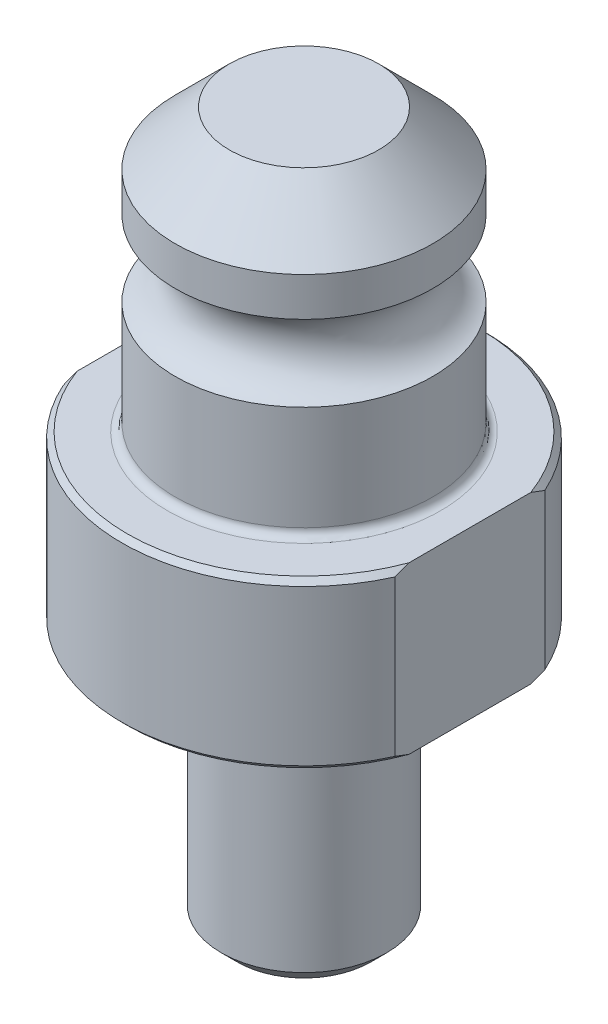
ISO-10303-21;
HEADER;
FILE_DESCRIPTION(('STEP AP214'),'2;1');
FILE_NAME('part.step','',(''),(''),'','','');
FILE_SCHEMA(('AUTOMOTIVE_DESIGN { 1 0 10303 214 1 1 1 1 }'));
ENDSEC;
DATA;
#1=APPLICATION_CONTEXT('core data for automotive mechanical design processes');
#2=APPLICATION_PROTOCOL_DEFINITION('international standard','automotive_design',2000,#1);
#3=PRODUCT_CONTEXT('',#1,'mechanical');
#4=PRODUCT('Part','Part','',(#3));
#5=PRODUCT_RELATED_PRODUCT_CATEGORY('part','',(#4));
#6=PRODUCT_DEFINITION_FORMATION('','',#4);
#7=PRODUCT_DEFINITION_CONTEXT('part definition',#1,'design');
#8=PRODUCT_DEFINITION('design','',#6,#7);
#9=PRODUCT_DEFINITION_SHAPE('','',#8);
#10=(LENGTH_UNIT() NAMED_UNIT(*) SI_UNIT(.MILLI.,.METRE.));
#11=(NAMED_UNIT(*) PLANE_ANGLE_UNIT() SI_UNIT($,.RADIAN.));
#12=(NAMED_UNIT(*) SI_UNIT($,.STERADIAN.) SOLID_ANGLE_UNIT());
#13=UNCERTAINTY_MEASURE_WITH_UNIT(LENGTH_MEASURE(1.E-05),#10,'distance_accuracy_value','');
#14=(GEOMETRIC_REPRESENTATION_CONTEXT(3) GLOBAL_UNCERTAINTY_ASSIGNED_CONTEXT((#13)) GLOBAL_UNIT_ASSIGNED_CONTEXT((#10,
#11,#12)) REPRESENTATION_CONTEXT('',''));
#15=CARTESIAN_POINT('',(0.,0.,0.));
#16=DIRECTION('',(0.,0.,1.));
#17=DIRECTION('',(1.,0.,0.));
#18=AXIS2_PLACEMENT_3D('',#15,#16,#17);
#19=CARTESIAN_POINT('',(0.,-24.9936,0.));
#20=DIRECTION('',(0.,1.,0.));
#21=DIRECTION('',(-1.,0.,0.));
#22=AXIS2_PLACEMENT_3D('',#19,#20,#21);
#23=CYLINDRICAL_SURFACE('',#22,17.5006);
#24=DIRECTION('',(0.,1.,0.));
#25=VECTOR('',#24,1.);
#26=CARTESIAN_POINT('',(-15.9512,-24.9936,-7.19932072629079));
#27=LINE('',#26,#25);
#28=CARTESIAN_POINT('',(-15.9512,0.507999999999996,-7.19932072629079));
#29=VERTEX_POINT('',#28);
#30=CARTESIAN_POINT('',(-15.9512,15.4432,-7.19932072629079));
#31=VERTEX_POINT('',#30);
#32=EDGE_CURVE('E178',#29,#31,#27,.T.);
#33=ORIENTED_EDGE('',*,*,#32,.T.);
#34=CARTESIAN_POINT('',(0.,15.4432,0.));
#35=DIRECTION('',(0.,1.,0.));
#36=DIRECTION('',(-1.,0.,0.));
#37=AXIS2_PLACEMENT_3D('',#34,#35,#36);
#38=CIRCLE('',#37,17.5006);
#39=CARTESIAN_POINT('',(15.9512,15.4432,-7.19932072629078));
#40=VERTEX_POINT('',#39);
#41=EDGE_CURVE('E196',#31,#40,#38,.F.);
#42=ORIENTED_EDGE('',*,*,#41,.T.);
#43=DIRECTION('',(0.,1.,0.));
#44=VECTOR('',#43,1.);
#45=CARTESIAN_POINT('',(15.9512,-24.9936,-7.19932072629078));
#46=LINE('',#45,#44);
#47=CARTESIAN_POINT('',(15.9512,0.507999999999994,-7.19932072629078));
#48=VERTEX_POINT('',#47);
#49=EDGE_CURVE('E158',#48,#40,#46,.T.);
#50=ORIENTED_EDGE('',*,*,#49,.F.);
#51=CARTESIAN_POINT('',(0.,0.507999999999995,0.));
#52=DIRECTION('',(0.,-1.,0.));
#53=DIRECTION('',(1.,0.,0.));
#54=AXIS2_PLACEMENT_3D('',#51,#52,#53);
#55=CIRCLE('',#54,17.5006);
#56=EDGE_CURVE('E199',#48,#29,#55,.F.);
#57=ORIENTED_EDGE('',*,*,#56,.T.);
#58=EDGE_LOOP('',(#33,#42,#50,#57));
#59=FACE_BOUND('',#58,.T.);
#60=ADVANCED_FACE('F31',(#59),#23,.T.);
#61=CARTESIAN_POINT('',(0.,0.507999999999995,0.));
#62=DIRECTION('',(0.,1.,0.));
#63=DIRECTION('',(-1.,0.,0.));
#64=AXIS2_PLACEMENT_3D('',#61,#62,#63);
#65=CONICAL_SURFACE('',#64,17.5006,0.785398163397452);
#66=CARTESIAN_POINT('',(-15.9512,5.49018623231728,-15.8440807662697));
#67=CARTESIAN_POINT('',(-15.9512,5.33331855744457,-15.6214794728509));
#68=CARTESIAN_POINT('',(-15.9512,5.17755738640043,-15.3980992119657));
#69=CARTESIAN_POINT('',(-15.9512,4.86847005721532,-14.9496497067666));
#70=CARTESIAN_POINT('',(-15.9512,4.71514398210003,-14.7245804052477));
#71=CARTESIAN_POINT('',(-15.9512,4.25903741321897,-14.0464719794216));
#72=CARTESIAN_POINT('',(-15.9512,3.96026306609822,-13.5907224159838));
#73=CARTESIAN_POINT('',(-15.9512,3.37200436886921,-12.6651342669889));
#74=CARTESIAN_POINT('',(-15.9512,3.0826850896435,-12.1951904248123));
#75=CARTESIAN_POINT('',(-15.9512,2.52043403952877,-11.2456262368423));
#76=CARTESIAN_POINT('',(-15.9512,2.24750036290198,-10.7660070250515));
#77=CARTESIAN_POINT('',(-15.9512,1.71400849174468,-9.78124920731766));
#78=CARTESIAN_POINT('',(-15.9512,1.45406329921326,-9.27577624291654));
#79=CARTESIAN_POINT('',(-15.9512,0.960948243877733,-8.25169575464089));
#80=CARTESIAN_POINT('',(-15.9512,0.72778343846775,-7.73308577237696));
#81=CARTESIAN_POINT('',(-15.9512,0.296046827262793,-6.6845797919387));
#82=CARTESIAN_POINT('',(-15.9512,0.0973072308993037,-6.15475352363041));
#83=CARTESIAN_POINT('',(-15.9512,-0.259177017835615,-5.08155110446057));
#84=CARTESIAN_POINT('',(-15.9512,-0.41694750603537,-4.53818373098553));
#85=CARTESIAN_POINT('',(-15.9512,-0.613327603162929,-3.72875630379116));
#86=CARTESIAN_POINT('',(-15.9512,-0.670953730322471,-3.46723716560476));
#87=CARTESIAN_POINT('',(-15.9512,-0.774423684269977,-2.9418913355493));
#88=CARTESIAN_POINT('',(-15.9512,-0.820269109873936,-2.678064961837));
#89=CARTESIAN_POINT('',(-15.9512,-0.899494742104051,-2.14844974124866));
#90=CARTESIAN_POINT('',(-15.9512,-0.932870672275868,-1.88266025292612));
#91=CARTESIAN_POINT('',(-15.9512,-0.986589835027558,-1.34975733354528));
#92=CARTESIAN_POINT('',(-15.9512,-1.00693294641153,-1.08264389019843));
#93=CARTESIAN_POINT('',(-15.9512,-1.03404617768828,-0.551410929993733));
#94=CARTESIAN_POINT('',(-15.9512,-1.0409991636762,-0.287300775742793));
#95=CARTESIAN_POINT('',(-15.9512,-1.04176714482769,0.240936131459228));
#96=CARTESIAN_POINT('',(-15.9512,-1.03558223166201,0.505062884281631));
#97=CARTESIAN_POINT('',(-15.9512,-1.01017894135487,1.03267143191991));
#98=CARTESIAN_POINT('',(-15.9512,-0.990961481674179,1.29615327082591));
#99=CARTESIAN_POINT('',(-15.9512,-0.9398263765106,1.8218929152748));
#100=CARTESIAN_POINT('',(-15.9512,-0.907907105985949,2.0841505598517));
#101=CARTESIAN_POINT('',(-15.9512,-0.794361149684901,2.86448675231813));
#102=CARTESIAN_POINT('',(-15.9512,-0.69474503623291,3.38003065377401));
#103=CARTESIAN_POINT('',(-15.9512,-0.452899788931995,4.40083717981346));
#104=CARTESIAN_POINT('',(-15.9512,-0.310665274140785,4.90609849752405));
#105=CARTESIAN_POINT('',(-15.9512,0.0119416656369383,5.91127661224854));
#106=CARTESIAN_POINT('',(-15.9512,0.192777145507108,6.41104317311145));
#107=CARTESIAN_POINT('',(-15.9512,0.584957702157397,7.39832008009631));
#108=CARTESIAN_POINT('',(-15.9512,0.79630210597568,7.88583069627985));
#109=CARTESIAN_POINT('',(-15.9512,1.17546115657222,8.70203049024443));
#110=CARTESIAN_POINT('',(-15.9512,1.3368504175566,9.0337419156856));
#111=CARTESIAN_POINT('',(-15.9512,1.67002431630826,9.69192141994139));
#112=CARTESIAN_POINT('',(-15.9512,1.84180954631686,10.0183891986909));
#113=CARTESIAN_POINT('',(-15.9512,2.19444965201561,10.666586842449));
#114=CARTESIAN_POINT('',(-15.9512,2.37530909892574,10.9883142116903));
#115=CARTESIAN_POINT('',(-15.9512,2.744827671878,11.6272609125146));
#116=CARTESIAN_POINT('',(-15.9512,2.93348702343625,11.9444801133976));
#117=CARTESIAN_POINT('',(-15.9512,3.31194152712336,12.5655260462383));
#118=CARTESIAN_POINT('',(-15.9512,3.50154064403976,12.8694725085367));
#119=CARTESIAN_POINT('',(-15.9512,3.88633596349832,13.4738063726896));
#120=CARTESIAN_POINT('',(-15.9512,4.08153229542715,13.7741936920428));
#121=CARTESIAN_POINT('',(-15.9512,4.47650493516132,14.3712128296604));
#122=CARTESIAN_POINT('',(-15.9512,4.6762730227307,14.6678500962076));
#123=CARTESIAN_POINT('',(-15.9512,5.08012687348065,15.258132523735));
#124=CARTESIAN_POINT('',(-15.9512,5.28421223726466,15.5517779578017));
#125=CARTESIAN_POINT('',(-15.9512,5.49018623231728,15.8440807662697));
#126=B_SPLINE_CURVE_WITH_KNOTS('',3,(#66,#67,#68,#69,#70,#71,#72,#73,#74,#75,#76,#77,#78,#79,
#80,#81,#82,#83,#84,#85,#86,#87,#88,#89,#90,#91,#92,#93,#94,#95,#96,#97,#98,#99,#100,#101,#102,
#103,#104,#105,#106,#107,#108,#109,#110,#111,#112,#113,#114,#115,#116,#117,#118,#119,#120,#121,
#122,#123,#124,#125),.UNSPECIFIED.,.F.,.F.,(4,2,2,2,2,2,2,2,2,2,2,2,2,2,2,2,2,2,2,2,2,2,2,2,2,2,
2,2,2,4),(0.,0.8169572077873,1.63394221055412,3.26861060354255,4.92393249487228,
6.57906148848407,8.28361939192268,9.98849866846517,11.6848189458543,13.3800668821591,
14.1832237311102,14.9862715221236,15.789594468748,16.5929248855931,17.3852043496372,
18.1774782855061,18.9696964529333,19.7620160076145,21.3349808211931,22.9081443189481,
24.5013619374286,26.0945444182926,27.2010301148671,28.3075789055668,29.414690839609,
30.5218348056339,31.5964674110226,32.6711248779539,33.7439820618858,34.816740424801),.UNSPECIFIED.);
#127=CARTESIAN_POINT('',(-15.9512,0.,-5.85727524707523));
#128=VERTEX_POINT('',#127);
#129=EDGE_CURVE('E179',#29,#128,#126,.T.);
#130=ORIENTED_EDGE('',*,*,#129,.F.);
#131=ORIENTED_EDGE('',*,*,#56,.F.);
#132=CARTESIAN_POINT('',(15.9512,5.49018623231727,15.8440807662697));
#133=CARTESIAN_POINT('',(15.9512,5.33331855744456,15.6214794728509));
#134=CARTESIAN_POINT('',(15.9512,5.17755738640042,15.3980992119657));
#135=CARTESIAN_POINT('',(15.9512,4.86847005721531,14.9496497067666));
#136=CARTESIAN_POINT('',(15.9512,4.71514398210003,14.7245804052477));
#137=CARTESIAN_POINT('',(15.9512,4.25903741321897,14.0464719794216));
#138=CARTESIAN_POINT('',(15.9512,3.96026306609821,13.5907224159837));
#139=CARTESIAN_POINT('',(15.9512,3.3720043688692,12.6651342669889));
#140=CARTESIAN_POINT('',(15.9512,3.08268508964349,12.1951904248123));
#141=CARTESIAN_POINT('',(15.9512,2.52043403952876,11.2456262368423));
#142=CARTESIAN_POINT('',(15.9512,2.24750036290198,10.7660070250515));
#143=CARTESIAN_POINT('',(15.9512,1.71400849174467,9.78124920731765));
#144=CARTESIAN_POINT('',(15.9512,1.45406329921325,9.27577624291652));
#145=CARTESIAN_POINT('',(15.9512,0.960948243877726,8.25169575464088));
#146=CARTESIAN_POINT('',(15.9512,0.727783438467745,7.73308577237695));
#147=CARTESIAN_POINT('',(15.9512,0.296046827262789,6.68457979193869));
#148=CARTESIAN_POINT('',(15.9512,0.0973072308992994,6.1547535236304));
#149=CARTESIAN_POINT('',(15.9512,-0.259177017835619,5.08155110446056));
#150=CARTESIAN_POINT('',(15.9512,-0.416947506035374,4.53818373098552));
#151=CARTESIAN_POINT('',(15.9512,-0.613327603162933,3.72875630379115));
#152=CARTESIAN_POINT('',(15.9512,-0.670953730322476,3.46723716560474));
#153=CARTESIAN_POINT('',(15.9512,-0.774423684269981,2.94189133554928));
#154=CARTESIAN_POINT('',(15.9512,-0.820269109873937,2.67806496183699));
#155=CARTESIAN_POINT('',(15.9512,-0.89949474210405,2.14844974124865));
#156=CARTESIAN_POINT('',(15.9512,-0.932870672275869,1.88266025292611));
#157=CARTESIAN_POINT('',(15.9512,-0.986589835027559,1.34975733354527));
#158=CARTESIAN_POINT('',(15.9512,-1.00693294641153,1.08264389019842));
#159=CARTESIAN_POINT('',(15.9512,-1.03404617768828,0.551410929993724));
#160=CARTESIAN_POINT('',(15.9512,-1.0409991636762,0.287300775742784));
#161=CARTESIAN_POINT('',(15.9512,-1.0417671448277,-0.240936131459235));
#162=CARTESIAN_POINT('',(15.9512,-1.03558223166201,-0.505062884281638));
#163=CARTESIAN_POINT('',(15.9512,-1.01017894135487,-1.03267143191992));
#164=CARTESIAN_POINT('',(15.9512,-0.99096148167418,-1.29615327082592));
#165=CARTESIAN_POINT('',(15.9512,-0.939826376510601,-1.82189291527481));
#166=CARTESIAN_POINT('',(15.9512,-0.907907105985949,-2.08415055985171));
#167=CARTESIAN_POINT('',(15.9512,-0.794361149684901,-2.86448675231814));
#168=CARTESIAN_POINT('',(15.9512,-0.694745036232908,-3.38003065377402));
#169=CARTESIAN_POINT('',(15.9512,-0.452899788931992,-4.40083717981347));
#170=CARTESIAN_POINT('',(15.9512,-0.310665274140782,-4.90609849752406));
#171=CARTESIAN_POINT('',(15.9512,0.0119416656369408,-5.91127661224855));
#172=CARTESIAN_POINT('',(15.9512,0.192777145507111,-6.41104317311146));
#173=CARTESIAN_POINT('',(15.9512,0.584957702157402,-7.39832008009632));
#174=CARTESIAN_POINT('',(15.9512,0.796302105975687,-7.88583069627986));
#175=CARTESIAN_POINT('',(15.9512,1.17546115657222,-8.70203049024443));
#176=CARTESIAN_POINT('',(15.9512,1.33685041755661,-9.03374191568561));
#177=CARTESIAN_POINT('',(15.9512,1.67002431630826,-9.6919214199414));
#178=CARTESIAN_POINT('',(15.9512,1.84180954631686,-10.0183891986909));
#179=CARTESIAN_POINT('',(15.9512,2.19444965201561,-10.666586842449));
#180=CARTESIAN_POINT('',(15.9512,2.37530909892574,-10.9883142116903));
#181=CARTESIAN_POINT('',(15.9512,2.74482767187801,-11.6272609125146));
#182=CARTESIAN_POINT('',(15.9512,2.93348702343625,-11.9444801133976));
#183=CARTESIAN_POINT('',(15.9512,3.31194152712336,-12.5655260462383));
#184=CARTESIAN_POINT('',(15.9512,3.50154064403976,-12.8694725085367));
#185=CARTESIAN_POINT('',(15.9512,3.88633596349832,-13.4738063726896));
#186=CARTESIAN_POINT('',(15.9512,4.08153229542715,-13.7741936920428));
#187=CARTESIAN_POINT('',(15.9512,4.47650493516131,-14.3712128296604));
#188=CARTESIAN_POINT('',(15.9512,4.67627302273069,-14.6678500962076));
#189=CARTESIAN_POINT('',(15.9512,5.08012687348064,-15.258132523735));
#190=CARTESIAN_POINT('',(15.9512,5.28421223726465,-15.5517779578016));
#191=CARTESIAN_POINT('',(15.9512,5.49018623231728,-15.8440807662697));
#192=B_SPLINE_CURVE_WITH_KNOTS('',3,(#132,#133,#134,#135,#136,#137,#138,#139,#140,#141,#142,
#143,#144,#145,#146,#147,#148,#149,#150,#151,#152,#153,#154,#155,#156,#157,#158,#159,#160,#161,
#162,#163,#164,#165,#166,#167,#168,#169,#170,#171,#172,#173,#174,#175,#176,#177,#178,#179,#180,
#181,#182,#183,#184,#185,#186,#187,#188,#189,#190,#191),.UNSPECIFIED.,.F.,.F.,(4,2,2,2,2,2,2,2,
2,2,2,2,2,2,2,2,2,2,2,2,2,2,2,2,2,2,2,2,2,4),(0.,0.816957207787301,1.63394221055412,
3.26861060354255,4.92393249487227,6.57906148848408,8.28361939192269,9.98849866846517,
11.6848189458543,13.3800668821591,14.1832237311102,14.9862715221236,15.789594468748,
16.5929248855931,17.3852043496372,18.1774782855061,18.9696964529333,19.7620160076145,
21.3349808211931,22.9081443189481,24.5013619374286,26.0945444182926,27.2010301148671,
28.3075789055668,29.414690839609,30.5218348056339,31.5964674110226,32.6711248779539,
33.7439820618857,34.816740424801),.UNSPECIFIED.);
#193=CARTESIAN_POINT('',(15.9512,0.,-5.85727524707523));
#194=VERTEX_POINT('',#193);
#195=EDGE_CURVE('E149',#194,#48,#192,.T.);
#196=ORIENTED_EDGE('',*,*,#195,.F.);
#197=CARTESIAN_POINT('',(0.,0.,0.));
#198=DIRECTION('',(0.,-1.,0.));
#199=DIRECTION('',(1.,0.,0.));
#200=AXIS2_PLACEMENT_3D('',#197,#198,#199);
#201=CIRCLE('',#200,16.9926);
#202=EDGE_CURVE('E116',#128,#194,#201,.T.);
#203=ORIENTED_EDGE('',*,*,#202,.F.);
#204=EDGE_LOOP('',(#130,#131,#196,#203));
#205=FACE_BOUND('',#204,.T.);
#206=ADVANCED_FACE('F166',(#205),#65,.T.);
#207=CARTESIAN_POINT('',(0.,15.9512,0.));
#208=DIRECTION('',(0.,-1.,0.));
#209=DIRECTION('',(1.,0.,0.));
#210=AXIS2_PLACEMENT_3D('',#207,#208,#209);
#211=CONICAL_SURFACE('',#210,16.9926,0.785398163397424);
#212=CARTESIAN_POINT('',(-15.9512,10.4610137676824,15.8440807662697));
#213=CARTESIAN_POINT('',(-15.9512,10.6178814425551,15.6214794728509));
#214=CARTESIAN_POINT('',(-15.9512,10.7736426135993,15.3980992119657));
#215=CARTESIAN_POINT('',(-15.9512,11.0827299427844,14.9496497067666));
#216=CARTESIAN_POINT('',(-15.9512,11.2360560178997,14.7245804052477));
#217=CARTESIAN_POINT('',(-15.9512,11.6921625867808,14.0464719794216));
#218=CARTESIAN_POINT('',(-15.9512,11.9909369339016,13.5907224159838));
#219=CARTESIAN_POINT('',(-15.9512,12.5791956311306,12.665134266989));
#220=CARTESIAN_POINT('',(-15.9512,12.8685149103563,12.1951904248123));
#221=CARTESIAN_POINT('',(-15.9512,13.4307659604711,11.2456262368424));
#222=CARTESIAN_POINT('',(-15.9512,13.7036996370979,10.7660070250515));
#223=CARTESIAN_POINT('',(-15.9512,14.2371915082552,9.7812492073177));
#224=CARTESIAN_POINT('',(-15.9512,14.4971367007866,9.27577624291657));
#225=CARTESIAN_POINT('',(-15.9512,14.9902517561222,8.25169575464092));
#226=CARTESIAN_POINT('',(-15.9512,15.2234165615322,7.73308577237699));
#227=CARTESIAN_POINT('',(-15.9512,15.6551531727372,6.68457979193872));
#228=CARTESIAN_POINT('',(-15.9512,15.8538927691007,6.15475352363042));
#229=CARTESIAN_POINT('',(-15.9512,16.2103770178356,5.08155110446058));
#230=CARTESIAN_POINT('',(-15.9512,16.3681475060354,4.53818373098553));
#231=CARTESIAN_POINT('',(-15.9512,16.564527603163,3.72875630379117));
#232=CARTESIAN_POINT('',(-15.9512,16.6221537303225,3.46723716560478));
#233=CARTESIAN_POINT('',(-15.9512,16.72562368427,2.94189133554935));
#234=CARTESIAN_POINT('',(-15.9512,16.771469109874,2.67806496183707));
#235=CARTESIAN_POINT('',(-15.9512,16.8506947421041,2.14844974124876));
#236=CARTESIAN_POINT('',(-15.9512,16.8840706722759,1.88266025292623));
#237=CARTESIAN_POINT('',(-15.9512,16.9377898350276,1.34975733354542));
#238=CARTESIAN_POINT('',(-15.9512,16.9581329464116,1.08264389019859));
#239=CARTESIAN_POINT('',(-15.9512,16.9852461776883,0.551410929993922));
#240=CARTESIAN_POINT('',(-15.9512,16.9921991636763,0.287300775742996));
#241=CARTESIAN_POINT('',(-15.9512,16.9929671448278,-0.240936131458995));
#242=CARTESIAN_POINT('',(-15.9512,16.9867822316621,-0.505062884281384));
#243=CARTESIAN_POINT('',(-15.9512,16.961378941355,-1.03267143191963));
#244=CARTESIAN_POINT('',(-15.9512,16.9421614816743,-1.29615327082562));
#245=CARTESIAN_POINT('',(-15.9512,16.8910263765107,-1.82189291527448));
#246=CARTESIAN_POINT('',(-15.9512,16.859107105986,-2.08415055985137));
#247=CARTESIAN_POINT('',(-15.9512,16.745561149685,-2.86448675231776));
#248=CARTESIAN_POINT('',(-15.9512,16.645945036233,-3.38003065377361));
#249=CARTESIAN_POINT('',(-15.9512,16.4040997889321,-4.400837179813));
#250=CARTESIAN_POINT('',(-15.9512,16.2618652741409,-4.90609849752357));
#251=CARTESIAN_POINT('',(-15.9512,15.9392583343633,-5.91127661224801));
#252=CARTESIAN_POINT('',(-15.9512,15.7584228544931,-6.4110431731109));
#253=CARTESIAN_POINT('',(-15.9512,15.3662422978428,-7.39832008009571));
#254=CARTESIAN_POINT('',(-15.9512,15.1548978940246,-7.88583069627922));
#255=CARTESIAN_POINT('',(-15.9512,14.775738843428,-8.70203049024381));
#256=CARTESIAN_POINT('',(-15.9512,14.6143495824436,-9.03374191568501));
#257=CARTESIAN_POINT('',(-15.9512,14.2811756836919,-9.69192141994087));
#258=CARTESIAN_POINT('',(-15.9512,14.1093904536833,-10.0183891986904));
#259=CARTESIAN_POINT('',(-15.9512,13.7567503479845,-10.6665868424485));
#260=CARTESIAN_POINT('',(-15.9512,13.5758909010744,-10.9883142116898));
#261=CARTESIAN_POINT('',(-15.9512,13.2063723281221,-11.6272609125142));
#262=CARTESIAN_POINT('',(-15.9512,13.0177129765638,-11.9444801133973));
#263=CARTESIAN_POINT('',(-15.9512,12.6392584728766,-12.565526046238));
#264=CARTESIAN_POINT('',(-15.9512,12.4496593559602,-12.8694725085365));
#265=CARTESIAN_POINT('',(-15.9512,12.0648640365016,-13.4738063726894));
#266=CARTESIAN_POINT('',(-15.9512,11.8696677045727,-13.7741936920427));
#267=CARTESIAN_POINT('',(-15.9512,11.4746950648385,-14.3712128296602));
#268=CARTESIAN_POINT('',(-15.9512,11.2749269772691,-14.6678500962075));
#269=CARTESIAN_POINT('',(-15.9512,10.8710731265191,-15.258132523735));
#270=CARTESIAN_POINT('',(-15.9512,10.6669877627351,-15.5517779578016));
#271=CARTESIAN_POINT('',(-15.9512,10.4610137676824,-15.8440807662697));
#272=B_SPLINE_CURVE_WITH_KNOTS('',3,(#212,#213,#214,#215,#216,#217,#218,#219,#220,#221,#222,
#223,#224,#225,#226,#227,#228,#229,#230,#231,#232,#233,#234,#235,#236,#237,#238,#239,#240,#241,
#242,#243,#244,#245,#246,#247,#248,#249,#250,#251,#252,#253,#254,#255,#256,#257,#258,#259,#260,
#261,#262,#263,#264,#265,#266,#267,#268,#269,#270,#271),.UNSPECIFIED.,.F.,.F.,(4,2,2,2,2,2,2,2,
2,2,2,2,2,2,2,2,2,2,2,2,2,2,2,2,2,2,2,2,2,4),(0.,0.816957207787307,1.63394221055413,
3.26861060354257,4.92393249487232,6.57906148848414,8.28361939192277,9.98849866846528,
11.6848189458544,13.3800668821593,14.1832237311103,14.9862715221237,15.7895944687481,
16.5929248855931,17.3852043496371,18.177478285506,18.9696964529332,19.7620160076144,
21.3349808211928,22.9081443189477,24.5013619374282,26.0945444182921,27.2010301148667,
28.3075789055665,29.4146908396088,30.5218348056338,31.5964674110226,32.671124877954,
33.743982061886,34.8167404248013),.UNSPECIFIED.);
#273=CARTESIAN_POINT('',(-15.9512,15.4432,7.19932072629079));
#274=VERTEX_POINT('',#273);
#275=CARTESIAN_POINT('',(-15.9512,15.9512,5.85727524707525));
#276=VERTEX_POINT('',#275);
#277=EDGE_CURVE('E95',#274,#276,#272,.T.);
#278=ORIENTED_EDGE('',*,*,#277,.F.);
#279=CARTESIAN_POINT('',(15.9512,15.4432,7.19932072629078));
#280=VERTEX_POINT('',#279);
#281=EDGE_CURVE('E202',#280,#274,#38,.F.);
#282=ORIENTED_EDGE('',*,*,#281,.F.);
#283=CARTESIAN_POINT('',(15.9512,10.4610137676824,-15.8440807662697));
#284=CARTESIAN_POINT('',(15.9512,10.6178814425552,-15.6214794728509));
#285=CARTESIAN_POINT('',(15.9512,10.7736426135993,-15.3980992119657));
#286=CARTESIAN_POINT('',(15.9512,11.0827299427844,-14.9496497067666));
#287=CARTESIAN_POINT('',(15.9512,11.2360560178997,-14.7245804052477));
#288=CARTESIAN_POINT('',(15.9512,11.6921625867808,-14.0464719794216));
#289=CARTESIAN_POINT('',(15.9512,11.9909369339016,-13.5907224159838));
#290=CARTESIAN_POINT('',(15.9512,12.5791956311306,-12.6651342669889));
#291=CARTESIAN_POINT('',(15.9512,12.8685149103563,-12.1951904248123));
#292=CARTESIAN_POINT('',(15.9512,13.4307659604711,-11.2456262368423));
#293=CARTESIAN_POINT('',(15.9512,13.7036996370979,-10.7660070250515));
#294=CARTESIAN_POINT('',(15.9512,14.2371915082552,-9.78124920731768));
#295=CARTESIAN_POINT('',(15.9512,14.4971367007867,-9.27577624291656));
#296=CARTESIAN_POINT('',(15.9512,14.9902517561222,-8.25169575464091));
#297=CARTESIAN_POINT('',(15.9512,15.2234165615322,-7.73308577237697));
#298=CARTESIAN_POINT('',(15.9512,15.6551531727372,-6.68457979193871));
#299=CARTESIAN_POINT('',(15.9512,15.8538927691007,-6.15475352363041));
#300=CARTESIAN_POINT('',(15.9512,16.2103770178356,-5.08155110446056));
#301=CARTESIAN_POINT('',(15.9512,16.3681475060354,-4.53818373098551));
#302=CARTESIAN_POINT('',(15.9512,16.564527603163,-3.72875630379116));
#303=CARTESIAN_POINT('',(15.9512,16.6221537303225,-3.46723716560477));
#304=CARTESIAN_POINT('',(15.9512,16.72562368427,-2.94189133554934));
#305=CARTESIAN_POINT('',(15.9512,16.771469109874,-2.67806496183706));
#306=CARTESIAN_POINT('',(15.9512,16.8506947421041,-2.14844974124875));
#307=CARTESIAN_POINT('',(15.9512,16.8840706722759,-1.88266025292622));
#308=CARTESIAN_POINT('',(15.9512,16.9377898350276,-1.34975733354541));
#309=CARTESIAN_POINT('',(15.9512,16.9581329464116,-1.08264389019858));
#310=CARTESIAN_POINT('',(15.9512,16.9852461776883,-0.551410929993914));
#311=CARTESIAN_POINT('',(15.9512,16.9921991636763,-0.28730077574299));
#312=CARTESIAN_POINT('',(15.9512,16.9929671448278,0.240936131459001));
#313=CARTESIAN_POINT('',(15.9512,16.9867822316621,0.50506288428139));
#314=CARTESIAN_POINT('',(15.9512,16.961378941355,1.03267143191964));
#315=CARTESIAN_POINT('',(15.9512,16.9421614816743,1.29615327082563));
#316=CARTESIAN_POINT('',(15.9512,16.8910263765107,1.82189291527448));
#317=CARTESIAN_POINT('',(15.9512,16.859107105986,2.08415055985138));
#318=CARTESIAN_POINT('',(15.9512,16.745561149685,2.86448675231776));
#319=CARTESIAN_POINT('',(15.9512,16.645945036233,3.38003065377362));
#320=CARTESIAN_POINT('',(15.9512,16.4040997889321,4.40083717981301));
#321=CARTESIAN_POINT('',(15.9512,16.2618652741409,4.90609849752357));
#322=CARTESIAN_POINT('',(15.9512,15.9392583343632,5.91127661224801));
#323=CARTESIAN_POINT('',(15.9512,15.7584228544931,6.4110431731109));
#324=CARTESIAN_POINT('',(15.9512,15.3662422978428,7.39832008009571));
#325=CARTESIAN_POINT('',(15.9512,15.1548978940246,7.88583069627922));
#326=CARTESIAN_POINT('',(15.9512,14.775738843428,8.7020304902438));
#327=CARTESIAN_POINT('',(15.9512,14.6143495824436,9.03374191568501));
#328=CARTESIAN_POINT('',(15.9512,14.2811756836919,9.69192141994086));
#329=CARTESIAN_POINT('',(15.9512,14.1093904536833,10.0183891986904));
#330=CARTESIAN_POINT('',(15.9512,13.7567503479845,10.6665868424485));
#331=CARTESIAN_POINT('',(15.9512,13.5758909010744,10.9883142116898));
#332=CARTESIAN_POINT('',(15.9512,13.2063723281221,11.6272609125142));
#333=CARTESIAN_POINT('',(15.9512,13.0177129765638,11.9444801133973));
#334=CARTESIAN_POINT('',(15.9512,12.6392584728766,12.565526046238));
#335=CARTESIAN_POINT('',(15.9512,12.4496593559602,12.8694725085365));
#336=CARTESIAN_POINT('',(15.9512,12.0648640365016,13.4738063726894));
#337=CARTESIAN_POINT('',(15.9512,11.8696677045727,13.7741936920426));
#338=CARTESIAN_POINT('',(15.9512,11.4746950648385,14.3712128296602));
#339=CARTESIAN_POINT('',(15.9512,11.2749269772691,14.6678500962075));
#340=CARTESIAN_POINT('',(15.9512,10.8710731265191,15.258132523735));
#341=CARTESIAN_POINT('',(15.9512,10.6669877627351,15.5517779578016));
#342=CARTESIAN_POINT('',(15.9512,10.4610137676824,15.8440807662697));
#343=B_SPLINE_CURVE_WITH_KNOTS('',3,(#283,#284,#285,#286,#287,#288,#289,#290,#291,#292,#293,
#294,#295,#296,#297,#298,#299,#300,#301,#302,#303,#304,#305,#306,#307,#308,#309,#310,#311,#312,
#313,#314,#315,#316,#317,#318,#319,#320,#321,#322,#323,#324,#325,#326,#327,#328,#329,#330,#331,
#332,#333,#334,#335,#336,#337,#338,#339,#340,#341,#342),.UNSPECIFIED.,.F.,.F.,(4,2,2,2,2,2,2,2,
2,2,2,2,2,2,2,2,2,2,2,2,2,2,2,2,2,2,2,2,2,4),(0.,0.816957207787307,1.63394221055413,
3.26861060354257,4.92393249487232,6.57906148848414,8.28361939192277,9.98849866846528,
11.6848189458544,13.3800668821593,14.1832237311103,14.9862715221237,15.7895944687481,
16.5929248855931,17.3852043496371,18.177478285506,18.9696964529332,19.7620160076143,
21.3349808211928,22.9081443189477,24.5013619374282,26.0945444182921,27.2010301148667,
28.3075789055665,29.4146908396088,30.5218348056338,31.5964674110226,32.671124877954,
33.7439820618859,34.8167404248013),.UNSPECIFIED.);
#344=CARTESIAN_POINT('',(15.9512,15.9512,5.85727524707525));
#345=VERTEX_POINT('',#344);
#346=EDGE_CURVE('E111',#345,#280,#343,.T.);
#347=ORIENTED_EDGE('',*,*,#346,.F.);
#348=CARTESIAN_POINT('',(0.,15.9512,0.));
#349=DIRECTION('',(0.,1.,0.));
#350=DIRECTION('',(-1.,0.,0.));
#351=AXIS2_PLACEMENT_3D('',#348,#349,#350);
#352=CIRCLE('',#351,16.9926);
#353=EDGE_CURVE('E53',#276,#345,#352,.T.);
#354=ORIENTED_EDGE('',*,*,#353,.F.);
#355=EDGE_LOOP('',(#278,#282,#347,#354));
#356=FACE_BOUND('',#355,.T.);
#357=ADVANCED_FACE('F110',(#356),#211,.T.);
#358=CARTESIAN_POINT('',(0.,-24.9936,0.));
#359=DIRECTION('',(0.,-1.,0.));
#360=DIRECTION('',(1.,0.,0.));
#361=AXIS2_PLACEMENT_3D('',#358,#359,#360);
#362=PLANE('',#361);
#363=CARTESIAN_POINT('',(0.,-24.9936,0.));
#364=DIRECTION('',(0.,-1.,0.));
#365=DIRECTION('',(1.,0.,0.));
#366=AXIS2_PLACEMENT_3D('',#363,#364,#365);
#367=CIRCLE('',#366,6.41350000000001);
#368=CARTESIAN_POINT('',(6.41350000000001,-24.9936,0.));
#369=VERTEX_POINT('',#368);
#370=EDGE_CURVE('E122',#369,#369,#367,.T.);
#371=ORIENTED_EDGE('',*,*,#370,.T.);
#372=EDGE_LOOP('',(#371));
#373=FACE_BOUND('',#372,.T.);
#374=ADVANCED_FACE('F167',(#373),#362,.T.);
#375=CARTESIAN_POINT('',(0.,-24.9936,0.));
#376=DIRECTION('',(0.,1.,0.));
#377=DIRECTION('',(-1.,0.,0.));
#378=AXIS2_PLACEMENT_3D('',#375,#376,#377);
#379=CYLINDRICAL_SURFACE('',#378,7.9375);
#380=CARTESIAN_POINT('',(0.,-23.4696,0.));
#381=DIRECTION('',(0.,-1.,0.));
#382=DIRECTION('',(1.,0.,0.));
#383=AXIS2_PLACEMENT_3D('',#380,#381,#382);
#384=CIRCLE('',#383,7.9375);
#385=CARTESIAN_POINT('',(7.9375,-23.4696,0.));
#386=VERTEX_POINT('',#385);
#387=EDGE_CURVE('E114',#386,#386,#384,.F.);
#388=ORIENTED_EDGE('',*,*,#387,.T.);
#389=EDGE_LOOP('',(#388));
#390=FACE_BOUND('',#389,.T.);
#391=CARTESIAN_POINT('',(0.,-3.81,0.));
#392=DIRECTION('',(0.,1.,0.));
#393=DIRECTION('',(-1.,0.,0.));
#394=AXIS2_PLACEMENT_3D('',#391,#392,#393);
#395=CIRCLE('',#394,7.9375);
#396=CARTESIAN_POINT('',(-7.9375,-3.81,0.));
#397=VERTEX_POINT('',#396);
#398=EDGE_CURVE('E205',#397,#397,#395,.T.);
#399=ORIENTED_EDGE('',*,*,#398,.F.);
#400=EDGE_LOOP('',(#399));
#401=FACE_BOUND('',#400,.T.);
#402=ADVANCED_FACE('F261',(#390,#401),#379,.T.);
#403=CARTESIAN_POINT('',(-7.9375,-3.81,0.));
#404=DIRECTION('',(0.,1.,0.));
#405=DIRECTION('',(-1.,0.,0.));
#406=AXIS2_PLACEMENT_3D('',#403,#404,#405);
#407=PLANE('',#406);
#408=ORIENTED_EDGE('',*,*,#398,.T.);
#409=EDGE_LOOP('',(#408));
#410=FACE_BOUND('',#409,.T.);
#411=CARTESIAN_POINT('',(0.,-3.81,0.));
#412=DIRECTION('',(0.,1.,0.));
#413=DIRECTION('',(-1.,0.,0.));
#414=AXIS2_PLACEMENT_3D('',#411,#412,#413);
#415=CIRCLE('',#414,6.223);
#416=CARTESIAN_POINT('',(-6.223,-3.81,0.));
#417=VERTEX_POINT('',#416);
#418=EDGE_CURVE('E208',#417,#417,#415,.T.);
#419=ORIENTED_EDGE('',*,*,#418,.F.);
#420=EDGE_LOOP('',(#419));
#421=FACE_BOUND('',#420,.T.);
#422=ADVANCED_FACE('F276',(#410,#421),#407,.T.);
#423=CARTESIAN_POINT('',(0.,-24.9936,0.));
#424=DIRECTION('',(0.,1.,0.));
#425=DIRECTION('',(-1.,0.,0.));
#426=AXIS2_PLACEMENT_3D('',#423,#424,#425);
#427=CYLINDRICAL_SURFACE('',#426,6.223);
#428=ORIENTED_EDGE('',*,*,#418,.T.);
#429=EDGE_LOOP('',(#428));
#430=FACE_BOUND('',#429,.T.);
#431=CARTESIAN_POINT('',(0.,-1.27,0.));
#432=DIRECTION('',(0.,1.,0.));
#433=DIRECTION('',(-1.,0.,0.));
#434=AXIS2_PLACEMENT_3D('',#431,#432,#433);
#435=CIRCLE('',#434,6.223);
#436=CARTESIAN_POINT('',(-6.223,-1.27,0.));
#437=VERTEX_POINT('',#436);
#438=EDGE_CURVE('E211',#437,#437,#435,.T.);
#439=ORIENTED_EDGE('',*,*,#438,.F.);
#440=EDGE_LOOP('',(#439));
#441=FACE_BOUND('',#440,.T.);
#442=ADVANCED_FACE('F281',(#430,#441),#427,.T.);
#443=CARTESIAN_POINT('',(0.,-1.27,0.));
#444=DIRECTION('',(0.,1.,0.));
#445=DIRECTION('',(-1.,0.,0.));
#446=AXIS2_PLACEMENT_3D('',#443,#444,#445);
#447=TOROIDAL_SURFACE('',#446,7.493,1.27);
#448=ORIENTED_EDGE('',*,*,#438,.T.);
#449=EDGE_LOOP('',(#448));
#450=FACE_BOUND('',#449,.T.);
#451=CARTESIAN_POINT('',(0.,0.,0.));
#452=DIRECTION('',(0.,1.,0.));
#453=DIRECTION('',(-1.,0.,0.));
#454=AXIS2_PLACEMENT_3D('',#451,#452,#453);
#455=CIRCLE('',#454,7.493);
#456=CARTESIAN_POINT('',(-7.493,0.,0.));
#457=VERTEX_POINT('',#456);
#458=EDGE_CURVE('E214',#457,#457,#455,.T.);
#459=ORIENTED_EDGE('',*,*,#458,.F.);
#460=EDGE_LOOP('',(#459));
#461=FACE_BOUND('',#460,.T.);
#462=ADVANCED_FACE('F249',(#450,#461),#447,.F.);
#463=CARTESIAN_POINT('',(-7.493,0.,0.));
#464=DIRECTION('',(0.,-1.,0.));
#465=DIRECTION('',(1.,0.,0.));
#466=AXIS2_PLACEMENT_3D('',#463,#464,#465);
#467=PLANE('',#466);
#468=DIRECTION('',(0.,0.,1.));
#469=VECTOR('',#468,1.);
#470=CARTESIAN_POINT('',(-15.9512,0.,0.));
#471=LINE('',#470,#469);
#472=CARTESIAN_POINT('',(-15.9512,0.,5.85727524707523));
#473=VERTEX_POINT('',#472);
#474=EDGE_CURVE('E177',#128,#473,#471,.T.);
#475=ORIENTED_EDGE('',*,*,#474,.F.);
#476=ORIENTED_EDGE('',*,*,#202,.T.);
#477=DIRECTION('',(0.,0.,-1.));
#478=VECTOR('',#477,1.);
#479=CARTESIAN_POINT('',(15.9512,0.,0.));
#480=LINE('',#479,#478);
#481=CARTESIAN_POINT('',(15.9512,0.,5.85727524707523));
#482=VERTEX_POINT('',#481);
#483=EDGE_CURVE('E155',#482,#194,#480,.T.);
#484=ORIENTED_EDGE('',*,*,#483,.F.);
#485=EDGE_CURVE('E112',#482,#473,#201,.T.);
#486=ORIENTED_EDGE('',*,*,#485,.T.);
#487=EDGE_LOOP('',(#475,#476,#484,#486));
#488=FACE_BOUND('',#487,.T.);
#489=ORIENTED_EDGE('',*,*,#458,.T.);
#490=EDGE_LOOP('',(#489));
#491=FACE_BOUND('',#490,.T.);
#492=ADVANCED_FACE('F235',(#488,#491),#467,.T.);
#493=DIRECTION('',(0.,1.,0.));
#494=VECTOR('',#493,1.);
#495=CARTESIAN_POINT('',(-15.9512,-24.9936,7.19932072629079));
#496=LINE('',#495,#494);
#497=CARTESIAN_POINT('',(-15.9512,0.507999999999996,7.19932072629079));
#498=VERTEX_POINT('',#497);
#499=EDGE_CURVE('E98',#498,#274,#496,.T.);
#500=ORIENTED_EDGE('',*,*,#499,.F.);
#501=CARTESIAN_POINT('',(15.9512,0.507999999999994,7.19932072629078));
#502=VERTEX_POINT('',#501);
#503=EDGE_CURVE('E201',#498,#502,#55,.F.);
#504=ORIENTED_EDGE('',*,*,#503,.T.);
#505=DIRECTION('',(0.,1.,0.));
#506=VECTOR('',#505,1.);
#507=CARTESIAN_POINT('',(15.9512,-24.9936,7.19932072629078));
#508=LINE('',#507,#506);
#509=EDGE_CURVE('E156',#502,#280,#508,.T.);
#510=ORIENTED_EDGE('',*,*,#509,.T.);
#511=ORIENTED_EDGE('',*,*,#281,.T.);
#512=EDGE_LOOP('',(#500,#504,#510,#511));
#513=FACE_BOUND('',#512,.T.);
#514=ADVANCED_FACE('F239',(#513),#23,.T.);
#515=CARTESIAN_POINT('',(-17.5006,15.9512,0.));
#516=DIRECTION('',(0.,1.,0.));
#517=DIRECTION('',(-1.,0.,0.));
#518=AXIS2_PLACEMENT_3D('',#515,#516,#517);
#519=PLANE('',#518);
#520=CARTESIAN_POINT('',(0.,15.9512,0.));
#521=DIRECTION('',(0.,1.,0.));
#522=DIRECTION('',(-1.,0.,0.));
#523=AXIS2_PLACEMENT_3D('',#520,#521,#522);
#524=CIRCLE('',#523,13.1445);
#525=CARTESIAN_POINT('',(-13.1445,15.9512,0.));
#526=VERTEX_POINT('',#525);
#527=EDGE_CURVE('E11',#526,#526,#524,.F.);
#528=ORIENTED_EDGE('',*,*,#527,.T.);
#529=EDGE_LOOP('',(#528));
#530=FACE_BOUND('',#529,.T.);
#531=DIRECTION('',(0.,0.,-1.));
#532=VECTOR('',#531,1.);
#533=CARTESIAN_POINT('',(-15.9512,15.9512,-7.19932072629079));
#534=LINE('',#533,#532);
#535=CARTESIAN_POINT('',(-15.9512,15.9512,-5.85727524707525));
#536=VERTEX_POINT('',#535);
#537=EDGE_CURVE('E46',#276,#536,#534,.T.);
#538=ORIENTED_EDGE('',*,*,#537,.F.);
#539=ORIENTED_EDGE('',*,*,#353,.T.);
#540=DIRECTION('',(0.,0.,1.));
#541=VECTOR('',#540,1.);
#542=CARTESIAN_POINT('',(15.9512,15.9512,-7.19932072629078));
#543=LINE('',#542,#541);
#544=CARTESIAN_POINT('',(15.9512,15.9512,-5.85727524707525));
#545=VERTEX_POINT('',#544);
#546=EDGE_CURVE('E182',#545,#345,#543,.T.);
#547=ORIENTED_EDGE('',*,*,#546,.F.);
#548=EDGE_CURVE('E107',#545,#536,#352,.T.);
#549=ORIENTED_EDGE('',*,*,#548,.T.);
#550=EDGE_LOOP('',(#538,#539,#547,#549));
#551=FACE_BOUND('',#550,.T.);
#552=ADVANCED_FACE('F105',(#530,#551),#519,.T.);
#553=CARTESIAN_POINT('',(0.,-24.9936,0.));
#554=DIRECTION('',(0.,1.,0.));
#555=DIRECTION('',(-1.,0.,0.));
#556=AXIS2_PLACEMENT_3D('',#553,#554,#555);
#557=CYLINDRICAL_SURFACE('',#556,12.3825);
#558=CARTESIAN_POINT('',(0.,16.7132,0.));
#559=DIRECTION('',(0.,1.,0.));
#560=DIRECTION('',(-1.,0.,0.));
#561=AXIS2_PLACEMENT_3D('',#558,#559,#560);
#562=CIRCLE('',#561,12.3825);
#563=CARTESIAN_POINT('',(-12.3825,16.7132,0.));
#564=VERTEX_POINT('',#563);
#565=EDGE_CURVE('E39',#564,#564,#562,.T.);
#566=ORIENTED_EDGE('',*,*,#565,.T.);
#567=EDGE_LOOP('',(#566));
#568=FACE_BOUND('',#567,.T.);
#569=CARTESIAN_POINT('',(0.,26.7462,0.));
#570=DIRECTION('',(0.,1.,0.));
#571=DIRECTION('',(-1.,0.,0.));
#572=AXIS2_PLACEMENT_3D('',#569,#570,#571);
#573=CIRCLE('',#572,12.3825);
#574=CARTESIAN_POINT('',(-12.3825,26.7462,0.));
#575=VERTEX_POINT('',#574);
#576=EDGE_CURVE('E217',#575,#575,#573,.T.);
#577=ORIENTED_EDGE('',*,*,#576,.F.);
#578=EDGE_LOOP('',(#577));
#579=FACE_BOUND('',#578,.T.);
#580=ADVANCED_FACE('F246',(#568,#579),#557,.T.);
#581=CARTESIAN_POINT('',(0.,30.4038,0.));
#582=DIRECTION('',(0.,1.,0.));
#583=DIRECTION('',(-1.,0.,0.));
#584=AXIS2_PLACEMENT_3D('',#581,#582,#583);
#585=TOROIDAL_SURFACE('',#584,13.4669913953488,3.81499139534884);
#586=ORIENTED_EDGE('',*,*,#576,.T.);
#587=EDGE_LOOP('',(#586));
#588=FACE_BOUND('',#587,.T.);
#589=CARTESIAN_POINT('',(0.,34.0614,0.));
#590=DIRECTION('',(0.,1.,0.));
#591=DIRECTION('',(-1.,0.,0.));
#592=AXIS2_PLACEMENT_3D('',#589,#590,#591);
#593=CIRCLE('',#592,12.3825);
#594=CARTESIAN_POINT('',(-12.3825,34.0614,0.));
#595=VERTEX_POINT('',#594);
#596=EDGE_CURVE('E220',#595,#595,#593,.T.);
#597=ORIENTED_EDGE('',*,*,#596,.F.);
#598=EDGE_LOOP('',(#597));
#599=FACE_BOUND('',#598,.T.);
#600=ADVANCED_FACE('F353',(#588,#599),#585,.F.);
#601=CARTESIAN_POINT('',(0.,-24.9936,0.));
#602=DIRECTION('',(0.,1.,0.));
#603=DIRECTION('',(-1.,0.,0.));
#604=AXIS2_PLACEMENT_3D('',#601,#602,#603);
#605=CYLINDRICAL_SURFACE('',#604,12.3825);
#606=ORIENTED_EDGE('',*,*,#596,.T.);
#607=EDGE_LOOP('',(#606));
#608=FACE_BOUND('',#607,.T.);
#609=CARTESIAN_POINT('',(0.,37.7951999999999,0.));
#610=DIRECTION('',(0.,1.,0.));
#611=DIRECTION('',(-1.,0.,0.));
#612=AXIS2_PLACEMENT_3D('',#609,#610,#611);
#613=CIRCLE('',#612,12.3825);
#614=CARTESIAN_POINT('',(-12.3825,37.7951999999999,0.));
#615=VERTEX_POINT('',#614);
#616=EDGE_CURVE('E223',#615,#615,#613,.T.);
#617=ORIENTED_EDGE('',*,*,#616,.F.);
#618=EDGE_LOOP('',(#617));
#619=FACE_BOUND('',#618,.T.);
#620=ADVANCED_FACE('F374',(#608,#619),#605,.T.);
#621=CARTESIAN_POINT('',(0.,43.0022,0.));
#622=DIRECTION('',(0.,-1.,0.));
#623=DIRECTION('',(1.,0.,0.));
#624=AXIS2_PLACEMENT_3D('',#621,#622,#623);
#625=CONICAL_SURFACE('',#624,7.17550000000001,0.785398163397436);
#626=ORIENTED_EDGE('',*,*,#616,.T.);
#627=EDGE_LOOP('',(#626));
#628=FACE_BOUND('',#627,.T.);
#629=CARTESIAN_POINT('',(0.,43.0022,0.));
#630=DIRECTION('',(0.,1.,0.));
#631=DIRECTION('',(-1.,0.,0.));
#632=AXIS2_PLACEMENT_3D('',#629,#630,#631);
#633=CIRCLE('',#632,7.17550000000001);
#634=CARTESIAN_POINT('',(-7.17550000000001,43.0022,0.));
#635=VERTEX_POINT('',#634);
#636=EDGE_CURVE('E225',#635,#635,#633,.T.);
#637=ORIENTED_EDGE('',*,*,#636,.F.);
#638=EDGE_LOOP('',(#637));
#639=FACE_BOUND('',#638,.T.);
#640=ADVANCED_FACE('F380',(#628,#639),#625,.T.);
#641=CARTESIAN_POINT('',(-7.17550000000001,43.0022,0.));
#642=DIRECTION('',(0.,1.,0.));
#643=DIRECTION('',(-1.,0.,0.));
#644=AXIS2_PLACEMENT_3D('',#641,#642,#643);
#645=PLANE('',#644);
#646=ORIENTED_EDGE('',*,*,#636,.T.);
#647=EDGE_LOOP('',(#646));
#648=FACE_BOUND('',#647,.T.);
#649=ADVANCED_FACE('F145',(#648),#645,.T.);
#650=EDGE_CURVE('E171',#473,#498,#126,.T.);
#651=ORIENTED_EDGE('',*,*,#650,.F.);
#652=ORIENTED_EDGE('',*,*,#485,.F.);
#653=EDGE_CURVE('E157',#502,#482,#192,.T.);
#654=ORIENTED_EDGE('',*,*,#653,.F.);
#655=ORIENTED_EDGE('',*,*,#503,.F.);
#656=EDGE_LOOP('',(#651,#652,#654,#655));
#657=FACE_BOUND('',#656,.T.);
#658=ADVANCED_FACE('F161',(#657),#65,.T.);
#659=EDGE_CURVE('E102',#536,#31,#272,.T.);
#660=ORIENTED_EDGE('',*,*,#659,.F.);
#661=ORIENTED_EDGE('',*,*,#548,.F.);
#662=EDGE_CURVE('E130',#40,#545,#343,.T.);
#663=ORIENTED_EDGE('',*,*,#662,.F.);
#664=ORIENTED_EDGE('',*,*,#41,.F.);
#665=EDGE_LOOP('',(#660,#661,#663,#664));
#666=FACE_BOUND('',#665,.T.);
#667=ADVANCED_FACE('F135',(#666),#211,.T.);
#668=CARTESIAN_POINT('',(0.,-23.4696,0.));
#669=DIRECTION('',(0.,1.,0.));
#670=DIRECTION('',(-1.,0.,0.));
#671=AXIS2_PLACEMENT_3D('',#668,#669,#670);
#672=CONICAL_SURFACE('',#671,7.9375,0.785398163397451);
#673=ORIENTED_EDGE('',*,*,#370,.F.);
#674=EDGE_LOOP('',(#673));
#675=FACE_BOUND('',#674,.T.);
#676=ORIENTED_EDGE('',*,*,#387,.F.);
#677=EDGE_LOOP('',(#676));
#678=FACE_BOUND('',#677,.T.);
#679=ADVANCED_FACE('F142',(#675,#678),#672,.T.);
#680=CARTESIAN_POINT('',(15.9512,-24.9936,-7.19932072629078));
#681=DIRECTION('',(-1.,0.,0.));
#682=DIRECTION('',(0.,-1.,0.));
#683=AXIS2_PLACEMENT_3D('',#680,#681,#682);
#684=PLANE('',#683);
#685=ORIENTED_EDGE('',*,*,#653,.T.);
#686=ORIENTED_EDGE('',*,*,#483,.T.);
#687=ORIENTED_EDGE('',*,*,#195,.T.);
#688=ORIENTED_EDGE('',*,*,#49,.T.);
#689=ORIENTED_EDGE('',*,*,#662,.T.);
#690=ORIENTED_EDGE('',*,*,#546,.T.);
#691=ORIENTED_EDGE('',*,*,#346,.T.);
#692=ORIENTED_EDGE('',*,*,#509,.F.);
#693=EDGE_LOOP('',(#685,#686,#687,#688,#689,#690,#691,#692));
#694=FACE_BOUND('',#693,.T.);
#695=ADVANCED_FACE('F138',(#694),#684,.F.);
#696=CARTESIAN_POINT('',(-15.9512,-24.9936,-7.19932072629079));
#697=DIRECTION('',(1.,0.,0.));
#698=DIRECTION('',(0.,1.,0.));
#699=AXIS2_PLACEMENT_3D('',#696,#697,#698);
#700=PLANE('',#699);
#701=ORIENTED_EDGE('',*,*,#129,.T.);
#702=ORIENTED_EDGE('',*,*,#474,.T.);
#703=ORIENTED_EDGE('',*,*,#650,.T.);
#704=ORIENTED_EDGE('',*,*,#499,.T.);
#705=ORIENTED_EDGE('',*,*,#277,.T.);
#706=ORIENTED_EDGE('',*,*,#537,.T.);
#707=ORIENTED_EDGE('',*,*,#659,.T.);
#708=ORIENTED_EDGE('',*,*,#32,.F.);
#709=EDGE_LOOP('',(#701,#702,#703,#704,#705,#706,#707,#708));
#710=FACE_BOUND('',#709,.T.);
#711=ADVANCED_FACE('F96',(#710),#700,.F.);
#712=CARTESIAN_POINT('',(0.,16.7132,0.));
#713=DIRECTION('',(0.,1.,0.));
#714=DIRECTION('',(-1.,0.,0.));
#715=AXIS2_PLACEMENT_3D('',#712,#713,#714);
#716=TOROIDAL_SURFACE('',#715,13.1445,0.762);
#717=ORIENTED_EDGE('',*,*,#527,.F.);
#718=EDGE_LOOP('',(#717));
#719=FACE_BOUND('',#718,.T.);
#720=ORIENTED_EDGE('',*,*,#565,.F.);
#721=EDGE_LOOP('',(#720));
#722=FACE_BOUND('',#721,.T.);
#723=ADVANCED_FACE('F33',(#719,#722),#716,.F.);
#724=CLOSED_SHELL('',(#60,#206,#357,#374,#402,#422,#442,#462,#492,#514,#552,#580,#600,#620,#640,
#649,#658,#667,#679,#695,#711,#723));
#725=MANIFOLD_SOLID_BREP('B2',#724);
#726=ADVANCED_BREP_SHAPE_REPRESENTATION('',(#18,#725),#14);
#727=SHAPE_DEFINITION_REPRESENTATION(#9,#726);
ENDSEC;
END-ISO-10303-21;
